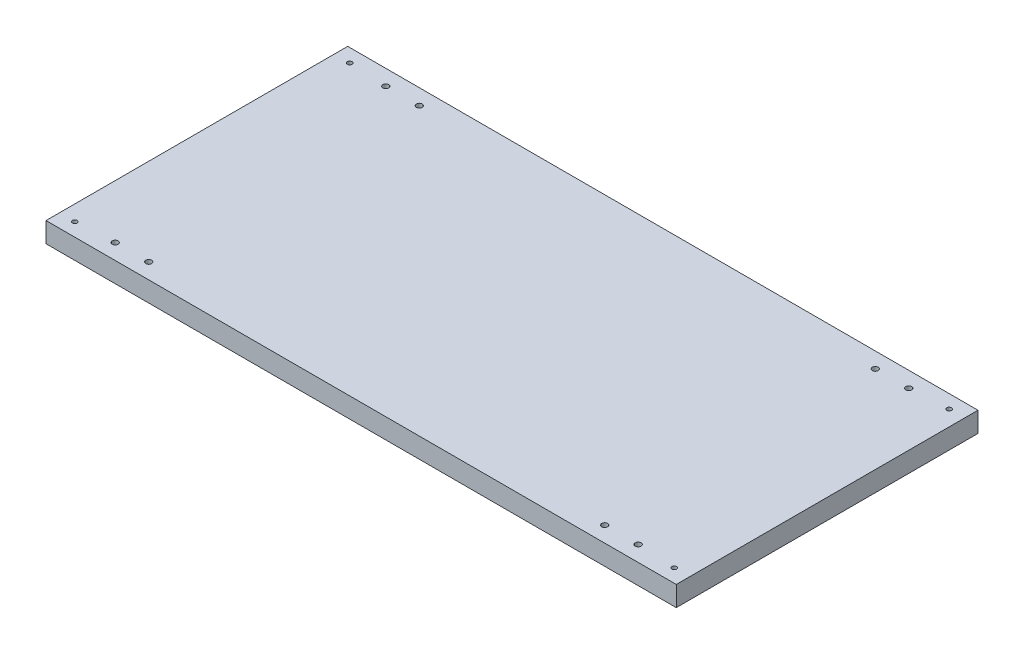
ISO-10303-21;
HEADER;
FILE_DESCRIPTION(('STEP AP214'),'2;1');
FILE_NAME('part.step','',(''),(''),'','','');
FILE_SCHEMA(('AUTOMOTIVE_DESIGN { 1 0 10303 214 1 1 1 1 }'));
ENDSEC;
DATA;
#1=APPLICATION_CONTEXT('core data for automotive mechanical design processes');
#2=APPLICATION_PROTOCOL_DEFINITION('international standard','automotive_design',2000,#1);
#3=PRODUCT_CONTEXT('',#1,'mechanical');
#4=PRODUCT('Part','Part','',(#3));
#5=PRODUCT_RELATED_PRODUCT_CATEGORY('part','',(#4));
#6=PRODUCT_DEFINITION_FORMATION('','',#4);
#7=PRODUCT_DEFINITION_CONTEXT('part definition',#1,'design');
#8=PRODUCT_DEFINITION('design','',#6,#7);
#9=PRODUCT_DEFINITION_SHAPE('','',#8);
#10=(LENGTH_UNIT() NAMED_UNIT(*) SI_UNIT(.MILLI.,.METRE.));
#11=(NAMED_UNIT(*) PLANE_ANGLE_UNIT() SI_UNIT($,.RADIAN.));
#12=(NAMED_UNIT(*) SI_UNIT($,.STERADIAN.) SOLID_ANGLE_UNIT());
#13=UNCERTAINTY_MEASURE_WITH_UNIT(LENGTH_MEASURE(1.E-05),#10,'distance_accuracy_value','');
#14=(GEOMETRIC_REPRESENTATION_CONTEXT(3) GLOBAL_UNCERTAINTY_ASSIGNED_CONTEXT((#13)) GLOBAL_UNIT_ASSIGNED_CONTEXT((#10,
#11,#12)) REPRESENTATION_CONTEXT('',''));
#15=CARTESIAN_POINT('',(0.,0.,0.));
#16=DIRECTION('',(0.,0.,1.));
#17=DIRECTION('',(1.,0.,0.));
#18=AXIS2_PLACEMENT_3D('',#15,#16,#17);
#19=CARTESIAN_POINT('',(0.,15.,0.));
#20=DIRECTION('',(0.,1.,0.));
#21=DIRECTION('',(0.,0.,1.));
#22=AXIS2_PLACEMENT_3D('',#19,#20,#21);
#23=PLANE('',#22);
#24=CARTESIAN_POINT('',(170.,15.,100.9));
#25=DIRECTION('',(0.,1.,0.));
#26=DIRECTION('',(0.,0.,1.));
#27=AXIS2_PLACEMENT_3D('',#24,#25,#26);
#28=CIRCLE('',#27,2.20000000000001);
#29=CARTESIAN_POINT('',(170.,15.,103.1));
#30=VERTEX_POINT('',#29);
#31=EDGE_CURVE('E177',#30,#30,#28,.T.);
#32=ORIENTED_EDGE('',*,*,#31,.F.);
#33=EDGE_LOOP('',(#32));
#34=FACE_BOUND('',#33,.T.);
#35=CARTESIAN_POINT('',(-170.,15.,100.9));
#36=DIRECTION('',(0.,1.,0.));
#37=DIRECTION('',(0.,0.,1.));
#38=AXIS2_PLACEMENT_3D('',#35,#36,#37);
#39=CIRCLE('',#38,2.20000000000001);
#40=CARTESIAN_POINT('',(-170.,15.,103.1));
#41=VERTEX_POINT('',#40);
#42=EDGE_CURVE('E171',#41,#41,#39,.T.);
#43=ORIENTED_EDGE('',*,*,#42,.F.);
#44=EDGE_LOOP('',(#43));
#45=FACE_BOUND('',#44,.T.);
#46=CARTESIAN_POINT('',(195.,15.,100.9));
#47=DIRECTION('',(0.,1.,0.));
#48=DIRECTION('',(0.,0.,1.));
#49=AXIS2_PLACEMENT_3D('',#46,#47,#48);
#50=CIRCLE('',#49,2.20000000000001);
#51=CARTESIAN_POINT('',(195.,15.,103.1));
#52=VERTEX_POINT('',#51);
#53=EDGE_CURVE('E165',#52,#52,#50,.T.);
#54=ORIENTED_EDGE('',*,*,#53,.F.);
#55=EDGE_LOOP('',(#54));
#56=FACE_BOUND('',#55,.T.);
#57=CARTESIAN_POINT('',(-195.,15.,100.9));
#58=DIRECTION('',(0.,1.,0.));
#59=DIRECTION('',(0.,0.,1.));
#60=AXIS2_PLACEMENT_3D('',#57,#58,#59);
#61=CIRCLE('',#60,2.20000000000001);
#62=CARTESIAN_POINT('',(-195.,15.,103.1));
#63=VERTEX_POINT('',#62);
#64=EDGE_CURVE('E159',#63,#63,#61,.T.);
#65=ORIENTED_EDGE('',*,*,#64,.F.);
#66=EDGE_LOOP('',(#65));
#67=FACE_BOUND('',#66,.T.);
#68=CARTESIAN_POINT('',(170.000001969325,15.,-100.909922976691));
#69=DIRECTION('',(0.,1.,0.));
#70=DIRECTION('',(0.,0.,1.));
#71=AXIS2_PLACEMENT_3D('',#68,#69,#70);
#72=CIRCLE('',#71,2.19999999998467);
#73=CARTESIAN_POINT('',(170.000001969325,15.,-98.7099229767064));
#74=VERTEX_POINT('',#73);
#75=EDGE_CURVE('E153',#74,#74,#72,.T.);
#76=ORIENTED_EDGE('',*,*,#75,.F.);
#77=EDGE_LOOP('',(#76));
#78=FACE_BOUND('',#77,.T.);
#79=CARTESIAN_POINT('',(195.,15.,-100.9));
#80=DIRECTION('',(0.,1.,0.));
#81=DIRECTION('',(0.,0.,1.));
#82=AXIS2_PLACEMENT_3D('',#79,#80,#81);
#83=CIRCLE('',#82,2.20000000000001);
#84=CARTESIAN_POINT('',(195.,15.,-98.7));
#85=VERTEX_POINT('',#84);
#86=EDGE_CURVE('E147',#85,#85,#83,.T.);
#87=ORIENTED_EDGE('',*,*,#86,.F.);
#88=EDGE_LOOP('',(#87));
#89=FACE_BOUND('',#88,.T.);
#90=CARTESIAN_POINT('',(-170.,15.,-100.9));
#91=DIRECTION('',(0.,1.,0.));
#92=DIRECTION('',(0.,0.,1.));
#93=AXIS2_PLACEMENT_3D('',#90,#91,#92);
#94=CIRCLE('',#93,2.20000000000001);
#95=CARTESIAN_POINT('',(-170.,15.,-98.7));
#96=VERTEX_POINT('',#95);
#97=EDGE_CURVE('E141',#96,#96,#94,.T.);
#98=ORIENTED_EDGE('',*,*,#97,.F.);
#99=EDGE_LOOP('',(#98));
#100=FACE_BOUND('',#99,.T.);
#101=CARTESIAN_POINT('',(-195.,15.,-100.9));
#102=DIRECTION('',(0.,1.,0.));
#103=DIRECTION('',(0.,0.,1.));
#104=AXIS2_PLACEMENT_3D('',#101,#102,#103);
#105=CIRCLE('',#104,2.20000000000001);
#106=CARTESIAN_POINT('',(-195.,15.,-98.7));
#107=VERTEX_POINT('',#106);
#108=EDGE_CURVE('E135',#107,#107,#105,.T.);
#109=ORIENTED_EDGE('',*,*,#108,.F.);
#110=EDGE_LOOP('',(#109));
#111=FACE_BOUND('',#110,.T.);
#112=CARTESIAN_POINT('',(-223.5,15.,102.5));
#113=DIRECTION('',(0.,1.,0.));
#114=DIRECTION('',(0.,0.,1.));
#115=AXIS2_PLACEMENT_3D('',#112,#113,#114);
#116=CIRCLE('',#115,1.75000000000001);
#117=CARTESIAN_POINT('',(-223.5,15.,104.25));
#118=VERTEX_POINT('',#117);
#119=EDGE_CURVE('E120',#118,#118,#116,.T.);
#120=ORIENTED_EDGE('',*,*,#119,.F.);
#121=EDGE_LOOP('',(#120));
#122=FACE_BOUND('',#121,.T.);
#123=CARTESIAN_POINT('',(223.5,15.,-102.5));
#124=DIRECTION('',(0.,1.,0.));
#125=DIRECTION('',(0.,0.,1.));
#126=AXIS2_PLACEMENT_3D('',#123,#124,#125);
#127=CIRCLE('',#126,1.75000000000001);
#128=CARTESIAN_POINT('',(223.5,15.,-100.75));
#129=VERTEX_POINT('',#128);
#130=EDGE_CURVE('E99',#129,#129,#127,.T.);
#131=ORIENTED_EDGE('',*,*,#130,.F.);
#132=EDGE_LOOP('',(#131));
#133=FACE_BOUND('',#132,.T.);
#134=DIRECTION('',(0.,0.,-1.));
#135=VECTOR('',#134,1.);
#136=CARTESIAN_POINT('',(235.,15.,-112.5));
#137=LINE('',#136,#135);
#138=CARTESIAN_POINT('',(235.,15.,112.5));
#139=VERTEX_POINT('',#138);
#140=CARTESIAN_POINT('',(235.,15.,-112.5));
#141=VERTEX_POINT('',#140);
#142=EDGE_CURVE('E84',#139,#141,#137,.T.);
#143=ORIENTED_EDGE('',*,*,#142,.T.);
#144=DIRECTION('',(-1.,0.,0.));
#145=VECTOR('',#144,1.);
#146=CARTESIAN_POINT('',(-235.,15.,-112.5));
#147=LINE('',#146,#145);
#148=CARTESIAN_POINT('',(-235.,15.,-112.5));
#149=VERTEX_POINT('',#148);
#150=EDGE_CURVE('E79',#141,#149,#147,.T.);
#151=ORIENTED_EDGE('',*,*,#150,.T.);
#152=DIRECTION('',(0.,0.,1.));
#153=VECTOR('',#152,1.);
#154=CARTESIAN_POINT('',(-235.,15.,-112.5));
#155=LINE('',#154,#153);
#156=CARTESIAN_POINT('',(-235.,15.,112.5));
#157=VERTEX_POINT('',#156);
#158=EDGE_CURVE('E82',#149,#157,#155,.T.);
#159=ORIENTED_EDGE('',*,*,#158,.T.);
#160=DIRECTION('',(1.,0.,0.));
#161=VECTOR('',#160,1.);
#162=CARTESIAN_POINT('',(-235.,15.,112.5));
#163=LINE('',#162,#161);
#164=EDGE_CURVE('E49',#157,#139,#163,.T.);
#165=ORIENTED_EDGE('',*,*,#164,.T.);
#166=EDGE_LOOP('',(#143,#151,#159,#165));
#167=FACE_BOUND('',#166,.T.);
#168=CARTESIAN_POINT('',(223.5,15.,102.5));
#169=DIRECTION('',(0.,1.,0.));
#170=DIRECTION('',(0.,0.,1.));
#171=AXIS2_PLACEMENT_3D('',#168,#169,#170);
#172=CIRCLE('',#171,1.75000000000001);
#173=CARTESIAN_POINT('',(223.5,15.,104.25));
#174=VERTEX_POINT('',#173);
#175=EDGE_CURVE('E114',#174,#174,#172,.T.);
#176=ORIENTED_EDGE('',*,*,#175,.F.);
#177=EDGE_LOOP('',(#176));
#178=FACE_BOUND('',#177,.T.);
#179=CARTESIAN_POINT('',(-223.5,15.,-102.5));
#180=DIRECTION('',(0.,1.,0.));
#181=DIRECTION('',(0.,0.,1.));
#182=AXIS2_PLACEMENT_3D('',#179,#180,#181);
#183=CIRCLE('',#182,1.75000000000001);
#184=CARTESIAN_POINT('',(-223.5,15.,-100.75));
#185=VERTEX_POINT('',#184);
#186=EDGE_CURVE('E126',#185,#185,#183,.T.);
#187=ORIENTED_EDGE('',*,*,#186,.F.);
#188=EDGE_LOOP('',(#187));
#189=FACE_BOUND('',#188,.T.);
#190=ADVANCED_FACE('F32',(#34,#45,#56,#67,#78,#89,#100,#111,#122,#133,#167,#178,#189),#23,.T.);
#191=CARTESIAN_POINT('',(0.,0.,0.));
#192=DIRECTION('',(0.,1.,0.));
#193=DIRECTION('',(0.,0.,1.));
#194=AXIS2_PLACEMENT_3D('',#191,#192,#193);
#195=PLANE('',#194);
#196=CARTESIAN_POINT('',(170.,0.,100.9));
#197=DIRECTION('',(0.,1.,0.));
#198=DIRECTION('',(0.,0.,1.));
#199=AXIS2_PLACEMENT_3D('',#196,#197,#198);
#200=CIRCLE('',#199,2.20000000000001);
#201=CARTESIAN_POINT('',(170.,0.,103.1));
#202=VERTEX_POINT('',#201);
#203=EDGE_CURVE('E174',#202,#202,#200,.T.);
#204=ORIENTED_EDGE('',*,*,#203,.T.);
#205=EDGE_LOOP('',(#204));
#206=FACE_BOUND('',#205,.T.);
#207=CARTESIAN_POINT('',(-170.,0.,100.9));
#208=DIRECTION('',(0.,1.,0.));
#209=DIRECTION('',(0.,0.,1.));
#210=AXIS2_PLACEMENT_3D('',#207,#208,#209);
#211=CIRCLE('',#210,2.20000000000001);
#212=CARTESIAN_POINT('',(-170.,0.,103.1));
#213=VERTEX_POINT('',#212);
#214=EDGE_CURVE('E168',#213,#213,#211,.T.);
#215=ORIENTED_EDGE('',*,*,#214,.T.);
#216=EDGE_LOOP('',(#215));
#217=FACE_BOUND('',#216,.T.);
#218=CARTESIAN_POINT('',(195.,0.,100.9));
#219=DIRECTION('',(0.,1.,0.));
#220=DIRECTION('',(0.,0.,1.));
#221=AXIS2_PLACEMENT_3D('',#218,#219,#220);
#222=CIRCLE('',#221,2.20000000000001);
#223=CARTESIAN_POINT('',(195.,0.,103.1));
#224=VERTEX_POINT('',#223);
#225=EDGE_CURVE('E162',#224,#224,#222,.T.);
#226=ORIENTED_EDGE('',*,*,#225,.T.);
#227=EDGE_LOOP('',(#226));
#228=FACE_BOUND('',#227,.T.);
#229=CARTESIAN_POINT('',(-195.,0.,100.9));
#230=DIRECTION('',(0.,1.,0.));
#231=DIRECTION('',(0.,0.,1.));
#232=AXIS2_PLACEMENT_3D('',#229,#230,#231);
#233=CIRCLE('',#232,2.20000000000001);
#234=CARTESIAN_POINT('',(-195.,0.,103.1));
#235=VERTEX_POINT('',#234);
#236=EDGE_CURVE('E156',#235,#235,#233,.T.);
#237=ORIENTED_EDGE('',*,*,#236,.T.);
#238=EDGE_LOOP('',(#237));
#239=FACE_BOUND('',#238,.T.);
#240=CARTESIAN_POINT('',(170.000001969325,0.,-100.909922976691));
#241=DIRECTION('',(0.,1.,0.));
#242=DIRECTION('',(0.,0.,1.));
#243=AXIS2_PLACEMENT_3D('',#240,#241,#242);
#244=CIRCLE('',#243,2.19999999998467);
#245=CARTESIAN_POINT('',(170.000001969325,0.,-98.7099229767064));
#246=VERTEX_POINT('',#245);
#247=EDGE_CURVE('E150',#246,#246,#244,.T.);
#248=ORIENTED_EDGE('',*,*,#247,.T.);
#249=EDGE_LOOP('',(#248));
#250=FACE_BOUND('',#249,.T.);
#251=CARTESIAN_POINT('',(195.,0.,-100.9));
#252=DIRECTION('',(0.,1.,0.));
#253=DIRECTION('',(0.,0.,1.));
#254=AXIS2_PLACEMENT_3D('',#251,#252,#253);
#255=CIRCLE('',#254,2.20000000000001);
#256=CARTESIAN_POINT('',(195.,0.,-98.7));
#257=VERTEX_POINT('',#256);
#258=EDGE_CURVE('E144',#257,#257,#255,.T.);
#259=ORIENTED_EDGE('',*,*,#258,.T.);
#260=EDGE_LOOP('',(#259));
#261=FACE_BOUND('',#260,.T.);
#262=CARTESIAN_POINT('',(-170.,0.,-100.9));
#263=DIRECTION('',(0.,1.,0.));
#264=DIRECTION('',(0.,0.,1.));
#265=AXIS2_PLACEMENT_3D('',#262,#263,#264);
#266=CIRCLE('',#265,2.20000000000001);
#267=CARTESIAN_POINT('',(-170.,0.,-98.7));
#268=VERTEX_POINT('',#267);
#269=EDGE_CURVE('E138',#268,#268,#266,.T.);
#270=ORIENTED_EDGE('',*,*,#269,.T.);
#271=EDGE_LOOP('',(#270));
#272=FACE_BOUND('',#271,.T.);
#273=CARTESIAN_POINT('',(-195.,0.,-100.9));
#274=DIRECTION('',(0.,1.,0.));
#275=DIRECTION('',(0.,0.,1.));
#276=AXIS2_PLACEMENT_3D('',#273,#274,#275);
#277=CIRCLE('',#276,2.20000000000001);
#278=CARTESIAN_POINT('',(-195.,0.,-98.7));
#279=VERTEX_POINT('',#278);
#280=EDGE_CURVE('E132',#279,#279,#277,.T.);
#281=ORIENTED_EDGE('',*,*,#280,.T.);
#282=EDGE_LOOP('',(#281));
#283=FACE_BOUND('',#282,.T.);
#284=CARTESIAN_POINT('',(-223.5,0.,102.5));
#285=DIRECTION('',(0.,1.,0.));
#286=DIRECTION('',(0.,0.,1.));
#287=AXIS2_PLACEMENT_3D('',#284,#285,#286);
#288=CIRCLE('',#287,1.75000000000001);
#289=CARTESIAN_POINT('',(-223.5,0.,104.25));
#290=VERTEX_POINT('',#289);
#291=EDGE_CURVE('E123',#290,#290,#288,.T.);
#292=ORIENTED_EDGE('',*,*,#291,.T.);
#293=EDGE_LOOP('',(#292));
#294=FACE_BOUND('',#293,.T.);
#295=CARTESIAN_POINT('',(223.5,0.,-102.5));
#296=DIRECTION('',(0.,1.,0.));
#297=DIRECTION('',(0.,0.,1.));
#298=AXIS2_PLACEMENT_3D('',#295,#296,#297);
#299=CIRCLE('',#298,1.75000000000001);
#300=CARTESIAN_POINT('',(223.5,0.,-100.75));
#301=VERTEX_POINT('',#300);
#302=EDGE_CURVE('E111',#301,#301,#299,.T.);
#303=ORIENTED_EDGE('',*,*,#302,.T.);
#304=EDGE_LOOP('',(#303));
#305=FACE_BOUND('',#304,.T.);
#306=DIRECTION('',(0.,0.,-1.));
#307=VECTOR('',#306,1.);
#308=CARTESIAN_POINT('',(235.,0.,-112.5));
#309=LINE('',#308,#307);
#310=CARTESIAN_POINT('',(235.,0.,112.5));
#311=VERTEX_POINT('',#310);
#312=CARTESIAN_POINT('',(235.,0.,-112.5));
#313=VERTEX_POINT('',#312);
#314=EDGE_CURVE('E96',#311,#313,#309,.T.);
#315=ORIENTED_EDGE('',*,*,#314,.F.);
#316=DIRECTION('',(1.,0.,0.));
#317=VECTOR('',#316,1.);
#318=CARTESIAN_POINT('',(-235.,0.,112.5));
#319=LINE('',#318,#317);
#320=CARTESIAN_POINT('',(-235.,0.,112.5));
#321=VERTEX_POINT('',#320);
#322=EDGE_CURVE('E72',#321,#311,#319,.T.);
#323=ORIENTED_EDGE('',*,*,#322,.F.);
#324=DIRECTION('',(0.,0.,1.));
#325=VECTOR('',#324,1.);
#326=CARTESIAN_POINT('',(-235.,0.,-112.5));
#327=LINE('',#326,#325);
#328=CARTESIAN_POINT('',(-235.,0.,-112.5));
#329=VERTEX_POINT('',#328);
#330=EDGE_CURVE('E66',#329,#321,#327,.T.);
#331=ORIENTED_EDGE('',*,*,#330,.F.);
#332=DIRECTION('',(-1.,0.,0.));
#333=VECTOR('',#332,1.);
#334=CARTESIAN_POINT('',(-235.,0.,-112.5));
#335=LINE('',#334,#333);
#336=EDGE_CURVE('E88',#313,#329,#335,.T.);
#337=ORIENTED_EDGE('',*,*,#336,.F.);
#338=EDGE_LOOP('',(#315,#323,#331,#337));
#339=FACE_BOUND('',#338,.T.);
#340=CARTESIAN_POINT('',(223.5,0.,102.5));
#341=DIRECTION('',(0.,1.,0.));
#342=DIRECTION('',(0.,0.,1.));
#343=AXIS2_PLACEMENT_3D('',#340,#341,#342);
#344=CIRCLE('',#343,1.75000000000001);
#345=CARTESIAN_POINT('',(223.5,0.,104.25));
#346=VERTEX_POINT('',#345);
#347=EDGE_CURVE('E117',#346,#346,#344,.T.);
#348=ORIENTED_EDGE('',*,*,#347,.T.);
#349=EDGE_LOOP('',(#348));
#350=FACE_BOUND('',#349,.T.);
#351=CARTESIAN_POINT('',(-223.5,0.,-102.5));
#352=DIRECTION('',(0.,1.,0.));
#353=DIRECTION('',(0.,0.,1.));
#354=AXIS2_PLACEMENT_3D('',#351,#352,#353);
#355=CIRCLE('',#354,1.75000000000001);
#356=CARTESIAN_POINT('',(-223.5,0.,-100.75));
#357=VERTEX_POINT('',#356);
#358=EDGE_CURVE('E129',#357,#357,#355,.T.);
#359=ORIENTED_EDGE('',*,*,#358,.T.);
#360=EDGE_LOOP('',(#359));
#361=FACE_BOUND('',#360,.T.);
#362=ADVANCED_FACE('F107',(#206,#217,#228,#239,#250,#261,#272,#283,#294,#305,#339,#350,#361),
#195,.F.);
#363=CARTESIAN_POINT('',(235.,15.,-112.5));
#364=DIRECTION('',(-1.,0.,0.));
#365=DIRECTION('',(0.,0.,1.));
#366=AXIS2_PLACEMENT_3D('',#363,#364,#365);
#367=PLANE('',#366);
#368=ORIENTED_EDGE('',*,*,#314,.T.);
#369=DIRECTION('',(0.,-1.,0.));
#370=VECTOR('',#369,1.);
#371=CARTESIAN_POINT('',(235.,15.,-112.5));
#372=LINE('',#371,#370);
#373=EDGE_CURVE('E11',#141,#313,#372,.T.);
#374=ORIENTED_EDGE('',*,*,#373,.F.);
#375=ORIENTED_EDGE('',*,*,#142,.F.);
#376=DIRECTION('',(0.,-1.,0.));
#377=VECTOR('',#376,1.);
#378=CARTESIAN_POINT('',(235.,15.,112.5));
#379=LINE('',#378,#377);
#380=EDGE_CURVE('E92',#139,#311,#379,.T.);
#381=ORIENTED_EDGE('',*,*,#380,.T.);
#382=EDGE_LOOP('',(#368,#374,#375,#381));
#383=FACE_BOUND('',#382,.T.);
#384=ADVANCED_FACE('F34',(#383),#367,.F.);
#385=CARTESIAN_POINT('',(-235.,15.,-112.5));
#386=DIRECTION('',(0.,0.,1.));
#387=DIRECTION('',(1.,0.,0.));
#388=AXIS2_PLACEMENT_3D('',#385,#386,#387);
#389=PLANE('',#388);
#390=ORIENTED_EDGE('',*,*,#336,.T.);
#391=DIRECTION('',(0.,-1.,0.));
#392=VECTOR('',#391,1.);
#393=CARTESIAN_POINT('',(-235.,15.,-112.5));
#394=LINE('',#393,#392);
#395=EDGE_CURVE('E41',#149,#329,#394,.T.);
#396=ORIENTED_EDGE('',*,*,#395,.F.);
#397=ORIENTED_EDGE('',*,*,#150,.F.);
#398=ORIENTED_EDGE('',*,*,#373,.T.);
#399=EDGE_LOOP('',(#390,#396,#397,#398));
#400=FACE_BOUND('',#399,.T.);
#401=ADVANCED_FACE('F87',(#400),#389,.F.);
#402=CARTESIAN_POINT('',(-235.,15.,-112.5));
#403=DIRECTION('',(1.,0.,0.));
#404=DIRECTION('',(0.,0.,-1.));
#405=AXIS2_PLACEMENT_3D('',#402,#403,#404);
#406=PLANE('',#405);
#407=ORIENTED_EDGE('',*,*,#330,.T.);
#408=DIRECTION('',(0.,-1.,0.));
#409=VECTOR('',#408,1.);
#410=CARTESIAN_POINT('',(-235.,15.,112.5));
#411=LINE('',#410,#409);
#412=EDGE_CURVE('E89',#157,#321,#411,.T.);
#413=ORIENTED_EDGE('',*,*,#412,.F.);
#414=ORIENTED_EDGE('',*,*,#158,.F.);
#415=ORIENTED_EDGE('',*,*,#395,.T.);
#416=EDGE_LOOP('',(#407,#413,#414,#415));
#417=FACE_BOUND('',#416,.T.);
#418=ADVANCED_FACE('F90',(#417),#406,.F.);
#419=CARTESIAN_POINT('',(-235.,15.,112.5));
#420=DIRECTION('',(0.,0.,-1.));
#421=DIRECTION('',(-1.,0.,0.));
#422=AXIS2_PLACEMENT_3D('',#419,#420,#421);
#423=PLANE('',#422);
#424=ORIENTED_EDGE('',*,*,#322,.T.);
#425=ORIENTED_EDGE('',*,*,#380,.F.);
#426=ORIENTED_EDGE('',*,*,#164,.F.);
#427=ORIENTED_EDGE('',*,*,#412,.T.);
#428=EDGE_LOOP('',(#424,#425,#426,#427));
#429=FACE_BOUND('',#428,.T.);
#430=ADVANCED_FACE('F104',(#429),#423,.F.);
#431=CARTESIAN_POINT('',(223.5,15.,-102.5));
#432=DIRECTION('',(0.,-1.,0.));
#433=DIRECTION('',(0.,0.,-1.));
#434=AXIS2_PLACEMENT_3D('',#431,#432,#433);
#435=CYLINDRICAL_SURFACE('',#434,1.75000000000001);
#436=ORIENTED_EDGE('',*,*,#130,.T.);
#437=EDGE_LOOP('',(#436));
#438=FACE_BOUND('',#437,.T.);
#439=ORIENTED_EDGE('',*,*,#302,.F.);
#440=EDGE_LOOP('',(#439));
#441=FACE_BOUND('',#440,.T.);
#442=ADVANCED_FACE('F213',(#438,#441),#435,.F.);
#443=CARTESIAN_POINT('',(223.5,15.,102.5));
#444=DIRECTION('',(0.,-1.,0.));
#445=DIRECTION('',(0.,0.,-1.));
#446=AXIS2_PLACEMENT_3D('',#443,#444,#445);
#447=CYLINDRICAL_SURFACE('',#446,1.75000000000001);
#448=ORIENTED_EDGE('',*,*,#175,.T.);
#449=EDGE_LOOP('',(#448));
#450=FACE_BOUND('',#449,.T.);
#451=ORIENTED_EDGE('',*,*,#347,.F.);
#452=EDGE_LOOP('',(#451));
#453=FACE_BOUND('',#452,.T.);
#454=ADVANCED_FACE('F216',(#450,#453),#447,.F.);
#455=CARTESIAN_POINT('',(-223.5,15.,102.5));
#456=DIRECTION('',(0.,-1.,0.));
#457=DIRECTION('',(0.,0.,-1.));
#458=AXIS2_PLACEMENT_3D('',#455,#456,#457);
#459=CYLINDRICAL_SURFACE('',#458,1.75000000000001);
#460=ORIENTED_EDGE('',*,*,#119,.T.);
#461=EDGE_LOOP('',(#460));
#462=FACE_BOUND('',#461,.T.);
#463=ORIENTED_EDGE('',*,*,#291,.F.);
#464=EDGE_LOOP('',(#463));
#465=FACE_BOUND('',#464,.T.);
#466=ADVANCED_FACE('F252',(#462,#465),#459,.F.);
#467=CARTESIAN_POINT('',(-223.5,15.,-102.5));
#468=DIRECTION('',(0.,-1.,0.));
#469=DIRECTION('',(0.,0.,-1.));
#470=AXIS2_PLACEMENT_3D('',#467,#468,#469);
#471=CYLINDRICAL_SURFACE('',#470,1.75000000000001);
#472=ORIENTED_EDGE('',*,*,#186,.T.);
#473=EDGE_LOOP('',(#472));
#474=FACE_BOUND('',#473,.T.);
#475=ORIENTED_EDGE('',*,*,#358,.F.);
#476=EDGE_LOOP('',(#475));
#477=FACE_BOUND('',#476,.T.);
#478=ADVANCED_FACE('F260',(#474,#477),#471,.F.);
#479=CARTESIAN_POINT('',(-195.,0.,-100.9));
#480=DIRECTION('',(0.,1.,0.));
#481=DIRECTION('',(0.,0.,1.));
#482=AXIS2_PLACEMENT_3D('',#479,#480,#481);
#483=CYLINDRICAL_SURFACE('',#482,2.20000000000001);
#484=ORIENTED_EDGE('',*,*,#280,.F.);
#485=EDGE_LOOP('',(#484));
#486=FACE_BOUND('',#485,.T.);
#487=ORIENTED_EDGE('',*,*,#108,.T.);
#488=EDGE_LOOP('',(#487));
#489=FACE_BOUND('',#488,.T.);
#490=ADVANCED_FACE('F268',(#486,#489),#483,.F.);
#491=CARTESIAN_POINT('',(-170.,0.,-100.9));
#492=DIRECTION('',(0.,1.,0.));
#493=DIRECTION('',(0.,0.,1.));
#494=AXIS2_PLACEMENT_3D('',#491,#492,#493);
#495=CYLINDRICAL_SURFACE('',#494,2.20000000000001);
#496=ORIENTED_EDGE('',*,*,#269,.F.);
#497=EDGE_LOOP('',(#496));
#498=FACE_BOUND('',#497,.T.);
#499=ORIENTED_EDGE('',*,*,#97,.T.);
#500=EDGE_LOOP('',(#499));
#501=FACE_BOUND('',#500,.T.);
#502=ADVANCED_FACE('F276',(#498,#501),#495,.F.);
#503=CARTESIAN_POINT('',(195.,0.,-100.9));
#504=DIRECTION('',(0.,1.,0.));
#505=DIRECTION('',(0.,0.,1.));
#506=AXIS2_PLACEMENT_3D('',#503,#504,#505);
#507=CYLINDRICAL_SURFACE('',#506,2.20000000000001);
#508=ORIENTED_EDGE('',*,*,#258,.F.);
#509=EDGE_LOOP('',(#508));
#510=FACE_BOUND('',#509,.T.);
#511=ORIENTED_EDGE('',*,*,#86,.T.);
#512=EDGE_LOOP('',(#511));
#513=FACE_BOUND('',#512,.T.);
#514=ADVANCED_FACE('F284',(#510,#513),#507,.F.);
#515=CARTESIAN_POINT('',(170.000001969325,0.,-100.909922976691));
#516=DIRECTION('',(0.,1.,0.));
#517=DIRECTION('',(0.,0.,1.));
#518=AXIS2_PLACEMENT_3D('',#515,#516,#517);
#519=CYLINDRICAL_SURFACE('',#518,2.19999999998467);
#520=ORIENTED_EDGE('',*,*,#247,.F.);
#521=EDGE_LOOP('',(#520));
#522=FACE_BOUND('',#521,.T.);
#523=ORIENTED_EDGE('',*,*,#75,.T.);
#524=EDGE_LOOP('',(#523));
#525=FACE_BOUND('',#524,.T.);
#526=ADVANCED_FACE('F292',(#522,#525),#519,.F.);
#527=CARTESIAN_POINT('',(-195.,0.,100.9));
#528=DIRECTION('',(0.,1.,0.));
#529=DIRECTION('',(0.,0.,1.));
#530=AXIS2_PLACEMENT_3D('',#527,#528,#529);
#531=CYLINDRICAL_SURFACE('',#530,2.20000000000001);
#532=ORIENTED_EDGE('',*,*,#236,.F.);
#533=EDGE_LOOP('',(#532));
#534=FACE_BOUND('',#533,.T.);
#535=ORIENTED_EDGE('',*,*,#64,.T.);
#536=EDGE_LOOP('',(#535));
#537=FACE_BOUND('',#536,.T.);
#538=ADVANCED_FACE('F300',(#534,#537),#531,.F.);
#539=CARTESIAN_POINT('',(195.,0.,100.9));
#540=DIRECTION('',(0.,1.,0.));
#541=DIRECTION('',(0.,0.,1.));
#542=AXIS2_PLACEMENT_3D('',#539,#540,#541);
#543=CYLINDRICAL_SURFACE('',#542,2.20000000000001);
#544=ORIENTED_EDGE('',*,*,#225,.F.);
#545=EDGE_LOOP('',(#544));
#546=FACE_BOUND('',#545,.T.);
#547=ORIENTED_EDGE('',*,*,#53,.T.);
#548=EDGE_LOOP('',(#547));
#549=FACE_BOUND('',#548,.T.);
#550=ADVANCED_FACE('F309',(#546,#549),#543,.F.);
#551=CARTESIAN_POINT('',(-170.,0.,100.9));
#552=DIRECTION('',(0.,1.,0.));
#553=DIRECTION('',(0.,0.,1.));
#554=AXIS2_PLACEMENT_3D('',#551,#552,#553);
#555=CYLINDRICAL_SURFACE('',#554,2.20000000000001);
#556=ORIENTED_EDGE('',*,*,#214,.F.);
#557=EDGE_LOOP('',(#556));
#558=FACE_BOUND('',#557,.T.);
#559=ORIENTED_EDGE('',*,*,#42,.T.);
#560=EDGE_LOOP('',(#559));
#561=FACE_BOUND('',#560,.T.);
#562=ADVANCED_FACE('F188',(#558,#561),#555,.F.);
#563=CARTESIAN_POINT('',(170.,0.,100.9));
#564=DIRECTION('',(0.,1.,0.));
#565=DIRECTION('',(0.,0.,1.));
#566=AXIS2_PLACEMENT_3D('',#563,#564,#565);
#567=CYLINDRICAL_SURFACE('',#566,2.20000000000001);
#568=ORIENTED_EDGE('',*,*,#203,.F.);
#569=EDGE_LOOP('',(#568));
#570=FACE_BOUND('',#569,.T.);
#571=ORIENTED_EDGE('',*,*,#31,.T.);
#572=EDGE_LOOP('',(#571));
#573=FACE_BOUND('',#572,.T.);
#574=ADVANCED_FACE('F185',(#570,#573),#567,.F.);
#575=CLOSED_SHELL('',(#190,#362,#384,#401,#418,#430,#442,#454,#466,#478,#490,#502,#514,#526,
#538,#550,#562,#574));
#576=MANIFOLD_SOLID_BREP('B2',#575);
#577=ADVANCED_BREP_SHAPE_REPRESENTATION('',(#18,#576),#14);
#578=SHAPE_DEFINITION_REPRESENTATION(#9,#577);
ENDSEC;
END-ISO-10303-21;
